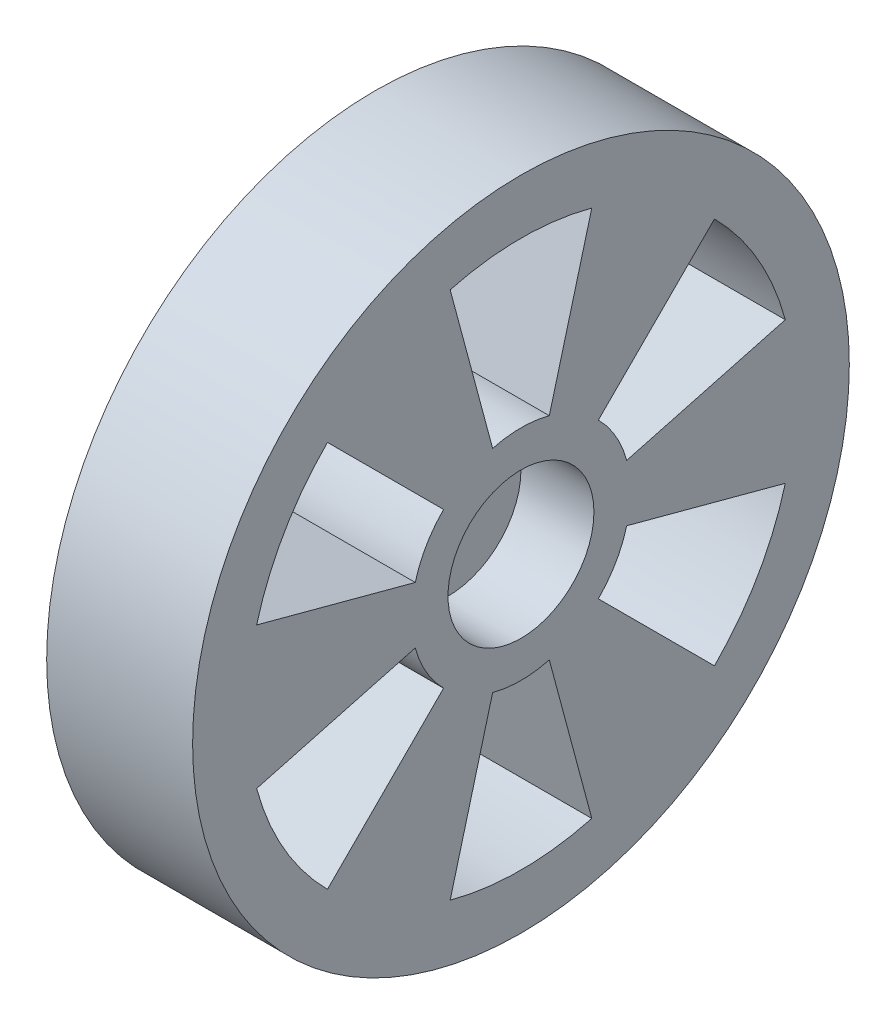
ISO-10303-21;
HEADER;
FILE_DESCRIPTION(('STEP AP214'),'2;1');
FILE_NAME('part.step','',(''),(''),'','','');
FILE_SCHEMA(('AUTOMOTIVE_DESIGN { 1 0 10303 214 1 1 1 1 }'));
ENDSEC;
DATA;
#1=APPLICATION_CONTEXT('core data for automotive mechanical design processes');
#2=APPLICATION_PROTOCOL_DEFINITION('international standard','automotive_design',2000,#1);
#3=PRODUCT_CONTEXT('',#1,'mechanical');
#4=PRODUCT('Part','Part','',(#3));
#5=PRODUCT_RELATED_PRODUCT_CATEGORY('part','',(#4));
#6=PRODUCT_DEFINITION_FORMATION('','',#4);
#7=PRODUCT_DEFINITION_CONTEXT('part definition',#1,'design');
#8=PRODUCT_DEFINITION('design','',#6,#7);
#9=PRODUCT_DEFINITION_SHAPE('','',#8);
#10=(LENGTH_UNIT() NAMED_UNIT(*) SI_UNIT(.MILLI.,.METRE.));
#11=(NAMED_UNIT(*) PLANE_ANGLE_UNIT() SI_UNIT($,.RADIAN.));
#12=(NAMED_UNIT(*) SI_UNIT($,.STERADIAN.) SOLID_ANGLE_UNIT());
#13=UNCERTAINTY_MEASURE_WITH_UNIT(LENGTH_MEASURE(1.E-05),#10,'distance_accuracy_value','');
#14=(GEOMETRIC_REPRESENTATION_CONTEXT(3) GLOBAL_UNCERTAINTY_ASSIGNED_CONTEXT((#13)) GLOBAL_UNIT_ASSIGNED_CONTEXT((#10,
#11,#12)) REPRESENTATION_CONTEXT('',''));
#15=CARTESIAN_POINT('',(0.,0.,0.));
#16=DIRECTION('',(0.,0.,1.));
#17=DIRECTION('',(1.,0.,0.));
#18=AXIS2_PLACEMENT_3D('',#15,#16,#17);
#19=CARTESIAN_POINT('',(20.,0.,0.));
#20=DIRECTION('',(-1.,0.,0.));
#21=DIRECTION('',(0.,0.,1.));
#22=AXIS2_PLACEMENT_3D('',#19,#20,#21);
#23=CYLINDRICAL_SURFACE('',#22,10.);
#24=CARTESIAN_POINT('',(20.,0.,0.));
#25=DIRECTION('',(1.,0.,0.));
#26=DIRECTION('',(0.,0.,-1.));
#27=AXIS2_PLACEMENT_3D('',#24,#25,#26);
#28=CIRCLE('',#27,10.);
#29=CARTESIAN_POINT('',(20.,0.,-10.));
#30=VERTEX_POINT('',#29);
#31=EDGE_CURVE('E11',#30,#30,#28,.T.);
#32=ORIENTED_EDGE('',*,*,#31,.F.);
#33=EDGE_LOOP('',(#32));
#34=FACE_BOUND('',#33,.T.);
#35=CARTESIAN_POINT('',(0.,0.,0.));
#36=DIRECTION('',(1.,0.,0.));
#37=DIRECTION('',(0.,0.,-1.));
#38=AXIS2_PLACEMENT_3D('',#35,#36,#37);
#39=CIRCLE('',#38,10.);
#40=CARTESIAN_POINT('',(0.,0.,-10.));
#41=VERTEX_POINT('',#40);
#42=EDGE_CURVE('E44',#41,#41,#39,.T.);
#43=ORIENTED_EDGE('',*,*,#42,.T.);
#44=EDGE_LOOP('',(#43));
#45=FACE_BOUND('',#44,.T.);
#46=ADVANCED_FACE('F41',(#34,#45),#23,.T.);
#47=CARTESIAN_POINT('',(0.,0.,0.));
#48=DIRECTION('',(1.,0.,0.));
#49=DIRECTION('',(0.,0.,-1.));
#50=AXIS2_PLACEMENT_3D('',#47,#48,#49);
#51=PLANE('',#50);
#52=ORIENTED_EDGE('',*,*,#42,.F.);
#53=EDGE_LOOP('',(#52));
#54=FACE_BOUND('',#53,.T.);
#55=ADVANCED_FACE('F506',(#54),#51,.F.);
#56=CARTESIAN_POINT('',(40.,0.,0.));
#57=DIRECTION('',(-1.,0.,0.));
#58=DIRECTION('',(0.,0.,1.));
#59=AXIS2_PLACEMENT_3D('',#56,#57,#58);
#60=CYLINDRICAL_SURFACE('',#59,45.);
#61=CARTESIAN_POINT('',(40.,0.,0.));
#62=DIRECTION('',(1.,0.,0.));
#63=DIRECTION('',(0.,0.,-1.));
#64=AXIS2_PLACEMENT_3D('',#61,#62,#63);
#65=CIRCLE('',#64,45.);
#66=CARTESIAN_POINT('',(40.,0.,-45.));
#67=VERTEX_POINT('',#66);
#68=EDGE_CURVE('E478',#67,#67,#65,.T.);
#69=ORIENTED_EDGE('',*,*,#68,.F.);
#70=EDGE_LOOP('',(#69));
#71=FACE_BOUND('',#70,.T.);
#72=CARTESIAN_POINT('',(20.,0.,0.));
#73=DIRECTION('',(1.,0.,0.));
#74=DIRECTION('',(0.,0.,-1.));
#75=AXIS2_PLACEMENT_3D('',#72,#73,#74);
#76=CIRCLE('',#75,45.);
#77=CARTESIAN_POINT('',(20.,0.,-45.));
#78=VERTEX_POINT('',#77);
#79=EDGE_CURVE('E468',#78,#78,#76,.T.);
#80=ORIENTED_EDGE('',*,*,#79,.T.);
#81=EDGE_LOOP('',(#80));
#82=FACE_BOUND('',#81,.T.);
#83=ADVANCED_FACE('F486',(#71,#82),#60,.T.);
#84=CARTESIAN_POINT('',(40.,0.,0.));
#85=DIRECTION('',(1.,0.,0.));
#86=DIRECTION('',(0.,0.,-1.));
#87=AXIS2_PLACEMENT_3D('',#84,#85,#86);
#88=PLANE('',#87);
#89=CARTESIAN_POINT('',(40.,0.,0.));
#90=DIRECTION('',(1.,0.,0.));
#91=DIRECTION('',(0.,0.,-1.));
#92=AXIS2_PLACEMENT_3D('',#89,#90,#91);
#93=CIRCLE('',#92,10.);
#94=CARTESIAN_POINT('',(40.,0.,-10.));
#95=VERTEX_POINT('',#94);
#96=EDGE_CURVE('E237',#95,#95,#93,.T.);
#97=ORIENTED_EDGE('',*,*,#96,.F.);
#98=EDGE_LOOP('',(#97));
#99=FACE_BOUND('',#98,.T.);
#100=CARTESIAN_POINT('',(40.,0.,0.));
#101=DIRECTION('',(1.,0.,0.));
#102=DIRECTION('',(0.,0.,1.));
#103=AXIS2_PLACEMENT_3D('',#100,#101,#102);
#104=CIRCLE('',#103,15.);
#105=CARTESIAN_POINT('',(40.,10.6066017177982,10.6066017177982));
#106=VERTEX_POINT('',#105);
#107=CARTESIAN_POINT('',(40.,3.88228567653776,14.488887394336));
#108=VERTEX_POINT('',#107);
#109=EDGE_CURVE('E262',#106,#108,#104,.T.);
#110=ORIENTED_EDGE('',*,*,#109,.T.);
#111=DIRECTION('',(0.,0.258819045102518,0.965925826289069));
#112=VECTOR('',#111,1.);
#113=CARTESIAN_POINT('',(40.,9.70571419134441,36.2222184858401));
#114=LINE('',#113,#112);
#115=CARTESIAN_POINT('',(40.,9.70571419134441,36.2222184858401));
#116=VERTEX_POINT('',#115);
#117=EDGE_CURVE('E266',#108,#116,#114,.T.);
#118=ORIENTED_EDGE('',*,*,#117,.T.);
#119=CARTESIAN_POINT('',(40.,0.,0.));
#120=DIRECTION('',(-1.,0.,0.));
#121=DIRECTION('',(0.,0.,1.));
#122=AXIS2_PLACEMENT_3D('',#119,#120,#121);
#123=CIRCLE('',#122,37.5);
#124=CARTESIAN_POINT('',(40.,26.5165042944955,26.5165042944956));
#125=VERTEX_POINT('',#124);
#126=EDGE_CURVE('E56',#116,#125,#123,.T.);
#127=ORIENTED_EDGE('',*,*,#126,.T.);
#128=DIRECTION('',(0.,-0.707106781186547,-0.707106781186548));
#129=VECTOR('',#128,1.);
#130=CARTESIAN_POINT('',(40.,26.5165042944955,26.5165042944956));
#131=LINE('',#130,#129);
#132=EDGE_CURVE('E273',#125,#106,#131,.T.);
#133=ORIENTED_EDGE('',*,*,#132,.T.);
#134=EDGE_LOOP('',(#110,#118,#127,#133));
#135=FACE_BOUND('',#134,.T.);
#136=CARTESIAN_POINT('',(40.,0.,0.));
#137=DIRECTION('',(1.,0.,0.));
#138=DIRECTION('',(0.,0.,1.));
#139=AXIS2_PLACEMENT_3D('',#136,#137,#138);
#140=CIRCLE('',#139,15.);
#141=CARTESIAN_POINT('',(40.,-3.88228567653787,14.488887394336));
#142=VERTEX_POINT('',#141);
#143=CARTESIAN_POINT('',(40.,-10.6066017177983,10.6066017177982));
#144=VERTEX_POINT('',#143);
#145=EDGE_CURVE('E306',#142,#144,#140,.T.);
#146=ORIENTED_EDGE('',*,*,#145,.T.);
#147=DIRECTION('',(0.,-0.707106781186552,0.707106781186543));
#148=VECTOR('',#147,1.);
#149=CARTESIAN_POINT('',(40.,-26.5165042944957,26.5165042944954));
#150=LINE('',#149,#148);
#151=CARTESIAN_POINT('',(40.,-26.5165042944957,26.5165042944954));
#152=VERTEX_POINT('',#151);
#153=EDGE_CURVE('E310',#144,#152,#150,.T.);
#154=ORIENTED_EDGE('',*,*,#153,.T.);
#155=CARTESIAN_POINT('',(40.,0.,0.));
#156=DIRECTION('',(-1.,0.,0.));
#157=DIRECTION('',(0.,0.,1.));
#158=AXIS2_PLACEMENT_3D('',#155,#156,#157);
#159=CIRCLE('',#158,37.5);
#160=CARTESIAN_POINT('',(40.,-9.70571419134466,36.22221848584));
#161=VERTEX_POINT('',#160);
#162=EDGE_CURVE('E64',#152,#161,#159,.T.);
#163=ORIENTED_EDGE('',*,*,#162,.T.);
#164=DIRECTION('',(0.,0.258819045102524,-0.965925826289067));
#165=VECTOR('',#164,1.);
#166=CARTESIAN_POINT('',(40.,-9.70571419134466,36.22221848584));
#167=LINE('',#166,#165);
#168=EDGE_CURVE('E317',#161,#142,#167,.T.);
#169=ORIENTED_EDGE('',*,*,#168,.T.);
#170=EDGE_LOOP('',(#146,#154,#163,#169));
#171=FACE_BOUND('',#170,.T.);
#172=CARTESIAN_POINT('',(40.,0.,0.));
#173=DIRECTION('',(1.,0.,0.));
#174=DIRECTION('',(0.,0.,1.));
#175=AXIS2_PLACEMENT_3D('',#172,#173,#174);
#176=CIRCLE('',#175,15.);
#177=CARTESIAN_POINT('',(40.,-14.488887394336,3.88228567653772));
#178=VERTEX_POINT('',#177);
#179=CARTESIAN_POINT('',(40.,-14.488887394336,-3.88228567653793));
#180=VERTEX_POINT('',#179);
#181=EDGE_CURVE('E348',#178,#180,#176,.T.);
#182=ORIENTED_EDGE('',*,*,#181,.T.);
#183=DIRECTION('',(0.,-0.965925826289066,-0.258819045102529));
#184=VECTOR('',#183,1.);
#185=CARTESIAN_POINT('',(40.,-36.22221848584,-9.70571419134482));
#186=LINE('',#185,#184);
#187=CARTESIAN_POINT('',(40.,-36.22221848584,-9.70571419134482));
#188=VERTEX_POINT('',#187);
#189=EDGE_CURVE('E352',#180,#188,#186,.T.);
#190=ORIENTED_EDGE('',*,*,#189,.T.);
#191=CARTESIAN_POINT('',(40.,0.,0.));
#192=DIRECTION('',(-1.,0.,0.));
#193=DIRECTION('',(0.,0.,1.));
#194=AXIS2_PLACEMENT_3D('',#191,#192,#193);
#195=CIRCLE('',#194,37.5);
#196=CARTESIAN_POINT('',(40.,-36.2222184858401,9.70571419134432));
#197=VERTEX_POINT('',#196);
#198=EDGE_CURVE('E357',#188,#197,#195,.T.);
#199=ORIENTED_EDGE('',*,*,#198,.T.);
#200=DIRECTION('',(0.,0.96592582628907,-0.258819045102515));
#201=VECTOR('',#200,1.);
#202=CARTESIAN_POINT('',(40.,-36.2222184858401,9.70571419134431));
#203=LINE('',#202,#201);
#204=EDGE_CURVE('E361',#197,#178,#203,.T.);
#205=ORIENTED_EDGE('',*,*,#204,.T.);
#206=EDGE_LOOP('',(#182,#190,#199,#205));
#207=FACE_BOUND('',#206,.T.);
#208=CARTESIAN_POINT('',(40.,0.,0.));
#209=DIRECTION('',(1.,0.,0.));
#210=DIRECTION('',(0.,0.,1.));
#211=AXIS2_PLACEMENT_3D('',#208,#209,#210);
#212=CIRCLE('',#211,15.);
#213=CARTESIAN_POINT('',(40.,-10.6066017177981,-10.6066017177983));
#214=VERTEX_POINT('',#213);
#215=CARTESIAN_POINT('',(40.,-3.88228567653766,-14.4888873943361));
#216=VERTEX_POINT('',#215);
#217=EDGE_CURVE('E392',#214,#216,#212,.T.);
#218=ORIENTED_EDGE('',*,*,#217,.T.);
#219=DIRECTION('',(0.,-0.258819045102511,-0.965925826289071));
#220=VECTOR('',#219,1.);
#221=CARTESIAN_POINT('',(40.,-9.70571419134416,-36.2222184858402));
#222=LINE('',#221,#220);
#223=CARTESIAN_POINT('',(40.,-9.70571419134416,-36.2222184858402));
#224=VERTEX_POINT('',#223);
#225=EDGE_CURVE('E396',#216,#224,#222,.T.);
#226=ORIENTED_EDGE('',*,*,#225,.T.);
#227=CARTESIAN_POINT('',(40.,0.,0.));
#228=DIRECTION('',(-1.,0.,0.));
#229=DIRECTION('',(0.,0.,1.));
#230=AXIS2_PLACEMENT_3D('',#227,#228,#229);
#231=CIRCLE('',#230,37.5);
#232=CARTESIAN_POINT('',(40.,-26.5165042944953,-26.5165042944958));
#233=VERTEX_POINT('',#232);
#234=EDGE_CURVE('E401',#224,#233,#231,.T.);
#235=ORIENTED_EDGE('',*,*,#234,.T.);
#236=DIRECTION('',(0.,0.707106781186542,0.707106781186553));
#237=VECTOR('',#236,1.);
#238=CARTESIAN_POINT('',(40.,-26.5165042944953,-26.5165042944957));
#239=LINE('',#238,#237);
#240=EDGE_CURVE('E405',#233,#214,#239,.T.);
#241=ORIENTED_EDGE('',*,*,#240,.T.);
#242=EDGE_LOOP('',(#218,#226,#235,#241));
#243=FACE_BOUND('',#242,.T.);
#244=CARTESIAN_POINT('',(40.,0.,0.));
#245=DIRECTION('',(1.,0.,0.));
#246=DIRECTION('',(0.,0.,1.));
#247=AXIS2_PLACEMENT_3D('',#244,#245,#246);
#248=CIRCLE('',#247,15.);
#249=CARTESIAN_POINT('',(40.,3.88228567653797,-14.488887394336));
#250=VERTEX_POINT('',#249);
#251=CARTESIAN_POINT('',(40.,10.6066017177983,-10.6066017177981));
#252=VERTEX_POINT('',#251);
#253=EDGE_CURVE('E206',#250,#252,#248,.T.);
#254=ORIENTED_EDGE('',*,*,#253,.T.);
#255=DIRECTION('',(0.,0.707106781186557,-0.707106781186538));
#256=VECTOR('',#255,1.);
#257=CARTESIAN_POINT('',(40.,26.5165042944959,-26.5165042944952));
#258=LINE('',#257,#256);
#259=CARTESIAN_POINT('',(40.,26.5165042944959,-26.5165042944952));
#260=VERTEX_POINT('',#259);
#261=EDGE_CURVE('E219',#252,#260,#258,.T.);
#262=ORIENTED_EDGE('',*,*,#261,.T.);
#263=CARTESIAN_POINT('',(40.,0.,0.));
#264=DIRECTION('',(-1.,0.,0.));
#265=DIRECTION('',(0.,0.,1.));
#266=AXIS2_PLACEMENT_3D('',#263,#264,#265);
#267=CIRCLE('',#266,37.5);
#268=CARTESIAN_POINT('',(40.,9.70571419134491,-36.22221848584));
#269=VERTEX_POINT('',#268);
#270=EDGE_CURVE('E224',#260,#269,#267,.T.);
#271=ORIENTED_EDGE('',*,*,#270,.T.);
#272=DIRECTION('',(0.,-0.258819045102531,0.965925826289065));
#273=VECTOR('',#272,1.);
#274=CARTESIAN_POINT('',(40.,9.70571419134491,-36.22221848584));
#275=LINE('',#274,#273);
#276=EDGE_CURVE('E215',#269,#250,#275,.T.);
#277=ORIENTED_EDGE('',*,*,#276,.T.);
#278=EDGE_LOOP('',(#254,#262,#271,#277));
#279=FACE_BOUND('',#278,.T.);
#280=CARTESIAN_POINT('',(40.,0.,0.));
#281=DIRECTION('',(1.,0.,0.));
#282=DIRECTION('',(0.,0.,1.));
#283=AXIS2_PLACEMENT_3D('',#280,#281,#282);
#284=CIRCLE('',#283,15.);
#285=CARTESIAN_POINT('',(40.,14.488887394336,-3.88228567653782));
#286=VERTEX_POINT('',#285);
#287=CARTESIAN_POINT('',(40.,14.488887394336,3.88228567653782));
#288=VERTEX_POINT('',#287);
#289=EDGE_CURVE('E434',#286,#288,#284,.T.);
#290=ORIENTED_EDGE('',*,*,#289,.T.);
#291=DIRECTION('',(0.,0.965925826289068,0.258819045102522));
#292=VECTOR('',#291,1.);
#293=CARTESIAN_POINT('',(40.,36.2222184858401,9.70571419134456));
#294=LINE('',#293,#292);
#295=CARTESIAN_POINT('',(40.,36.2222184858401,9.70571419134456));
#296=VERTEX_POINT('',#295);
#297=EDGE_CURVE('E438',#288,#296,#294,.T.);
#298=ORIENTED_EDGE('',*,*,#297,.T.);
#299=CARTESIAN_POINT('',(40.,0.,0.));
#300=DIRECTION('',(-1.,0.,0.));
#301=DIRECTION('',(0.,0.,1.));
#302=AXIS2_PLACEMENT_3D('',#299,#300,#301);
#303=CIRCLE('',#302,37.5);
#304=CARTESIAN_POINT('',(40.,36.2222184858401,-9.70571419134456));
#305=VERTEX_POINT('',#304);
#306=EDGE_CURVE('E443',#296,#305,#303,.T.);
#307=ORIENTED_EDGE('',*,*,#306,.T.);
#308=DIRECTION('',(0.,-0.965925826289068,0.258819045102522));
#309=VECTOR('',#308,1.);
#310=CARTESIAN_POINT('',(40.,36.2222184858401,-9.70571419134456));
#311=LINE('',#310,#309);
#312=EDGE_CURVE('E447',#305,#286,#311,.T.);
#313=ORIENTED_EDGE('',*,*,#312,.T.);
#314=EDGE_LOOP('',(#290,#298,#307,#313));
#315=FACE_BOUND('',#314,.T.);
#316=ORIENTED_EDGE('',*,*,#68,.T.);
#317=EDGE_LOOP('',(#316));
#318=FACE_BOUND('',#317,.T.);
#319=ADVANCED_FACE('F226',(#99,#135,#171,#207,#243,#279,#315,#318),#88,.T.);
#320=CARTESIAN_POINT('',(20.,0.,0.));
#321=DIRECTION('',(1.,0.,0.));
#322=DIRECTION('',(0.,0.,-1.));
#323=AXIS2_PLACEMENT_3D('',#320,#321,#322);
#324=PLANE('',#323);
#325=DIRECTION('',(0.,0.258819045102518,0.965925826289069));
#326=VECTOR('',#325,1.);
#327=CARTESIAN_POINT('',(20.,9.70571419134441,36.2222184858401));
#328=LINE('',#327,#326);
#329=CARTESIAN_POINT('',(20.,3.88228567653776,14.488887394336));
#330=VERTEX_POINT('',#329);
#331=CARTESIAN_POINT('',(20.,9.70571419134441,36.2222184858401));
#332=VERTEX_POINT('',#331);
#333=EDGE_CURVE('E281',#330,#332,#328,.T.);
#334=ORIENTED_EDGE('',*,*,#333,.F.);
#335=CARTESIAN_POINT('',(20.,0.,0.));
#336=DIRECTION('',(1.,0.,0.));
#337=DIRECTION('',(0.,0.,1.));
#338=AXIS2_PLACEMENT_3D('',#335,#336,#337);
#339=CIRCLE('',#338,15.);
#340=CARTESIAN_POINT('',(20.,10.6066017177982,10.6066017177982));
#341=VERTEX_POINT('',#340);
#342=EDGE_CURVE('E278',#341,#330,#339,.T.);
#343=ORIENTED_EDGE('',*,*,#342,.F.);
#344=DIRECTION('',(0.,-0.707106781186547,-0.707106781186548));
#345=VECTOR('',#344,1.);
#346=CARTESIAN_POINT('',(20.,26.5165042944955,26.5165042944956));
#347=LINE('',#346,#345);
#348=CARTESIAN_POINT('',(20.,26.5165042944955,26.5165042944956));
#349=VERTEX_POINT('',#348);
#350=EDGE_CURVE('E267',#349,#341,#347,.T.);
#351=ORIENTED_EDGE('',*,*,#350,.F.);
#352=CARTESIAN_POINT('',(20.,0.,0.));
#353=DIRECTION('',(-1.,0.,0.));
#354=DIRECTION('',(0.,0.,1.));
#355=AXIS2_PLACEMENT_3D('',#352,#353,#354);
#356=CIRCLE('',#355,37.5);
#357=EDGE_CURVE('E286',#332,#349,#356,.T.);
#358=ORIENTED_EDGE('',*,*,#357,.F.);
#359=EDGE_LOOP('',(#334,#343,#351,#358));
#360=FACE_BOUND('',#359,.T.);
#361=DIRECTION('',(0.,-0.707106781186552,0.707106781186543));
#362=VECTOR('',#361,1.);
#363=CARTESIAN_POINT('',(20.,-26.5165042944957,26.5165042944954));
#364=LINE('',#363,#362);
#365=CARTESIAN_POINT('',(20.,-10.6066017177983,10.6066017177982));
#366=VERTEX_POINT('',#365);
#367=CARTESIAN_POINT('',(20.,-26.5165042944957,26.5165042944954));
#368=VERTEX_POINT('',#367);
#369=EDGE_CURVE('E325',#366,#368,#364,.T.);
#370=ORIENTED_EDGE('',*,*,#369,.F.);
#371=CARTESIAN_POINT('',(20.,0.,0.));
#372=DIRECTION('',(1.,0.,0.));
#373=DIRECTION('',(0.,0.,1.));
#374=AXIS2_PLACEMENT_3D('',#371,#372,#373);
#375=CIRCLE('',#374,15.);
#376=CARTESIAN_POINT('',(20.,-3.88228567653787,14.488887394336));
#377=VERTEX_POINT('',#376);
#378=EDGE_CURVE('E322',#377,#366,#375,.T.);
#379=ORIENTED_EDGE('',*,*,#378,.F.);
#380=DIRECTION('',(0.,0.258819045102524,-0.965925826289067));
#381=VECTOR('',#380,1.);
#382=CARTESIAN_POINT('',(20.,-9.70571419134466,36.22221848584));
#383=LINE('',#382,#381);
#384=CARTESIAN_POINT('',(20.,-9.70571419134466,36.22221848584));
#385=VERTEX_POINT('',#384);
#386=EDGE_CURVE('E311',#385,#377,#383,.T.);
#387=ORIENTED_EDGE('',*,*,#386,.F.);
#388=CARTESIAN_POINT('',(20.,0.,0.));
#389=DIRECTION('',(-1.,0.,0.));
#390=DIRECTION('',(0.,0.,1.));
#391=AXIS2_PLACEMENT_3D('',#388,#389,#390);
#392=CIRCLE('',#391,37.5);
#393=EDGE_CURVE('E330',#368,#385,#392,.T.);
#394=ORIENTED_EDGE('',*,*,#393,.F.);
#395=EDGE_LOOP('',(#370,#379,#387,#394));
#396=FACE_BOUND('',#395,.T.);
#397=DIRECTION('',(0.,-0.965925826289066,-0.258819045102529));
#398=VECTOR('',#397,1.);
#399=CARTESIAN_POINT('',(20.,-36.22221848584,-9.70571419134482));
#400=LINE('',#399,#398);
#401=CARTESIAN_POINT('',(20.,-14.488887394336,-3.88228567653793));
#402=VERTEX_POINT('',#401);
#403=CARTESIAN_POINT('',(20.,-36.22221848584,-9.70571419134482));
#404=VERTEX_POINT('',#403);
#405=EDGE_CURVE('E369',#402,#404,#400,.T.);
#406=ORIENTED_EDGE('',*,*,#405,.F.);
#407=CARTESIAN_POINT('',(20.,0.,0.));
#408=DIRECTION('',(1.,0.,0.));
#409=DIRECTION('',(0.,0.,1.));
#410=AXIS2_PLACEMENT_3D('',#407,#408,#409);
#411=CIRCLE('',#410,15.);
#412=CARTESIAN_POINT('',(20.,-14.488887394336,3.88228567653772));
#413=VERTEX_POINT('',#412);
#414=EDGE_CURVE('E366',#413,#402,#411,.T.);
#415=ORIENTED_EDGE('',*,*,#414,.F.);
#416=DIRECTION('',(0.,0.96592582628907,-0.258819045102515));
#417=VECTOR('',#416,1.);
#418=CARTESIAN_POINT('',(20.,-36.2222184858401,9.70571419134431));
#419=LINE('',#418,#417);
#420=CARTESIAN_POINT('',(20.,-36.2222184858401,9.70571419134432));
#421=VERTEX_POINT('',#420);
#422=EDGE_CURVE('E353',#421,#413,#419,.T.);
#423=ORIENTED_EDGE('',*,*,#422,.F.);
#424=CARTESIAN_POINT('',(20.,0.,0.));
#425=DIRECTION('',(-1.,0.,0.));
#426=DIRECTION('',(0.,0.,1.));
#427=AXIS2_PLACEMENT_3D('',#424,#425,#426);
#428=CIRCLE('',#427,37.5);
#429=EDGE_CURVE('E374',#404,#421,#428,.T.);
#430=ORIENTED_EDGE('',*,*,#429,.F.);
#431=EDGE_LOOP('',(#406,#415,#423,#430));
#432=FACE_BOUND('',#431,.T.);
#433=DIRECTION('',(0.,-0.258819045102511,-0.965925826289071));
#434=VECTOR('',#433,1.);
#435=CARTESIAN_POINT('',(20.,-9.70571419134416,-36.2222184858402));
#436=LINE('',#435,#434);
#437=CARTESIAN_POINT('',(20.,-3.88228567653767,-14.4888873943361));
#438=VERTEX_POINT('',#437);
#439=CARTESIAN_POINT('',(20.,-9.70571419134416,-36.2222184858402));
#440=VERTEX_POINT('',#439);
#441=EDGE_CURVE('E412',#438,#440,#436,.T.);
#442=ORIENTED_EDGE('',*,*,#441,.F.);
#443=CARTESIAN_POINT('',(20.,0.,0.));
#444=DIRECTION('',(1.,0.,0.));
#445=DIRECTION('',(0.,0.,1.));
#446=AXIS2_PLACEMENT_3D('',#443,#444,#445);
#447=CIRCLE('',#446,15.);
#448=CARTESIAN_POINT('',(20.,-10.6066017177981,-10.6066017177983));
#449=VERTEX_POINT('',#448);
#450=EDGE_CURVE('E256',#449,#438,#447,.T.);
#451=ORIENTED_EDGE('',*,*,#450,.F.);
#452=DIRECTION('',(0.,0.707106781186542,0.707106781186553));
#453=VECTOR('',#452,1.);
#454=CARTESIAN_POINT('',(20.,-26.5165042944953,-26.5165042944957));
#455=LINE('',#454,#453);
#456=CARTESIAN_POINT('',(20.,-26.5165042944953,-26.5165042944958));
#457=VERTEX_POINT('',#456);
#458=EDGE_CURVE('E397',#457,#449,#455,.T.);
#459=ORIENTED_EDGE('',*,*,#458,.F.);
#460=CARTESIAN_POINT('',(20.,0.,0.));
#461=DIRECTION('',(-1.,0.,0.));
#462=DIRECTION('',(0.,0.,1.));
#463=AXIS2_PLACEMENT_3D('',#460,#461,#462);
#464=CIRCLE('',#463,37.5);
#465=EDGE_CURVE('E416',#440,#457,#464,.T.);
#466=ORIENTED_EDGE('',*,*,#465,.F.);
#467=EDGE_LOOP('',(#442,#451,#459,#466));
#468=FACE_BOUND('',#467,.T.);
#469=DIRECTION('',(0.,0.707106781186557,-0.707106781186538));
#470=VECTOR('',#469,1.);
#471=CARTESIAN_POINT('',(20.,26.5165042944959,-26.5165042944952));
#472=LINE('',#471,#470);
#473=CARTESIAN_POINT('',(20.,10.6066017177983,-10.6066017177981));
#474=VERTEX_POINT('',#473);
#475=CARTESIAN_POINT('',(20.,26.5165042944959,-26.5165042944952));
#476=VERTEX_POINT('',#475);
#477=EDGE_CURVE('E246',#474,#476,#472,.T.);
#478=ORIENTED_EDGE('',*,*,#477,.F.);
#479=CARTESIAN_POINT('',(20.,0.,0.));
#480=DIRECTION('',(1.,0.,0.));
#481=DIRECTION('',(0.,0.,1.));
#482=AXIS2_PLACEMENT_3D('',#479,#480,#481);
#483=CIRCLE('',#482,15.);
#484=CARTESIAN_POINT('',(20.,3.88228567653797,-14.488887394336));
#485=VERTEX_POINT('',#484);
#486=EDGE_CURVE('E209',#485,#474,#483,.T.);
#487=ORIENTED_EDGE('',*,*,#486,.F.);
#488=DIRECTION('',(0.,-0.258819045102531,0.965925826289065));
#489=VECTOR('',#488,1.);
#490=CARTESIAN_POINT('',(20.,9.70571419134491,-36.22221848584));
#491=LINE('',#490,#489);
#492=CARTESIAN_POINT('',(20.,9.70571419134491,-36.22221848584));
#493=VERTEX_POINT('',#492);
#494=EDGE_CURVE('E230',#493,#485,#491,.T.);
#495=ORIENTED_EDGE('',*,*,#494,.F.);
#496=CARTESIAN_POINT('',(20.,0.,0.));
#497=DIRECTION('',(-1.,0.,0.));
#498=DIRECTION('',(0.,0.,1.));
#499=AXIS2_PLACEMENT_3D('',#496,#497,#498);
#500=CIRCLE('',#499,37.5);
#501=EDGE_CURVE('E234',#476,#493,#500,.T.);
#502=ORIENTED_EDGE('',*,*,#501,.F.);
#503=EDGE_LOOP('',(#478,#487,#495,#502));
#504=FACE_BOUND('',#503,.T.);
#505=DIRECTION('',(0.,0.965925826289068,0.258819045102522));
#506=VECTOR('',#505,1.);
#507=CARTESIAN_POINT('',(20.,36.2222184858401,9.70571419134456));
#508=LINE('',#507,#506);
#509=CARTESIAN_POINT('',(20.,14.488887394336,3.88228567653782));
#510=VERTEX_POINT('',#509);
#511=CARTESIAN_POINT('',(20.,36.2222184858401,9.70571419134456));
#512=VERTEX_POINT('',#511);
#513=EDGE_CURVE('E454',#510,#512,#508,.T.);
#514=ORIENTED_EDGE('',*,*,#513,.F.);
#515=CARTESIAN_POINT('',(20.,0.,0.));
#516=DIRECTION('',(1.,0.,0.));
#517=DIRECTION('',(0.,0.,1.));
#518=AXIS2_PLACEMENT_3D('',#515,#516,#517);
#519=CIRCLE('',#518,15.);
#520=CARTESIAN_POINT('',(20.,14.488887394336,-3.88228567653782));
#521=VERTEX_POINT('',#520);
#522=EDGE_CURVE('E296',#521,#510,#519,.T.);
#523=ORIENTED_EDGE('',*,*,#522,.F.);
#524=DIRECTION('',(0.,-0.965925826289068,0.258819045102522));
#525=VECTOR('',#524,1.);
#526=CARTESIAN_POINT('',(20.,36.2222184858401,-9.70571419134456));
#527=LINE('',#526,#525);
#528=CARTESIAN_POINT('',(20.,36.2222184858401,-9.70571419134456));
#529=VERTEX_POINT('',#528);
#530=EDGE_CURVE('E439',#529,#521,#527,.T.);
#531=ORIENTED_EDGE('',*,*,#530,.F.);
#532=CARTESIAN_POINT('',(20.,0.,0.));
#533=DIRECTION('',(-1.,0.,0.));
#534=DIRECTION('',(0.,0.,1.));
#535=AXIS2_PLACEMENT_3D('',#532,#533,#534);
#536=CIRCLE('',#535,37.5);
#537=EDGE_CURVE('E458',#512,#529,#536,.T.);
#538=ORIENTED_EDGE('',*,*,#537,.F.);
#539=EDGE_LOOP('',(#514,#523,#531,#538));
#540=FACE_BOUND('',#539,.T.);
#541=ORIENTED_EDGE('',*,*,#31,.T.);
#542=EDGE_LOOP('',(#541));
#543=FACE_BOUND('',#542,.T.);
#544=ORIENTED_EDGE('',*,*,#79,.F.);
#545=EDGE_LOOP('',(#544));
#546=FACE_BOUND('',#545,.T.);
#547=ADVANCED_FACE('F488',(#360,#396,#432,#468,#504,#540,#543,#546),#324,.F.);
#548=CARTESIAN_POINT('',(40.,0.,0.));
#549=DIRECTION('',(-1.,0.,0.));
#550=DIRECTION('',(0.,0.,1.));
#551=AXIS2_PLACEMENT_3D('',#548,#549,#550);
#552=CYLINDRICAL_SURFACE('',#551,15.);
#553=ORIENTED_EDGE('',*,*,#522,.T.);
#554=DIRECTION('',(-1.,0.,0.));
#555=VECTOR('',#554,1.);
#556=CARTESIAN_POINT('',(40.,14.488887394336,3.88228567653782));
#557=LINE('',#556,#555);
#558=EDGE_CURVE('E451',#288,#510,#557,.T.);
#559=ORIENTED_EDGE('',*,*,#558,.F.);
#560=ORIENTED_EDGE('',*,*,#289,.F.);
#561=DIRECTION('',(-1.,0.,0.));
#562=VECTOR('',#561,1.);
#563=CARTESIAN_POINT('',(40.,14.488887394336,-3.88228567653782));
#564=LINE('',#563,#562);
#565=EDGE_CURVE('E465',#286,#521,#564,.T.);
#566=ORIENTED_EDGE('',*,*,#565,.T.);
#567=EDGE_LOOP('',(#553,#559,#560,#566));
#568=FACE_BOUND('',#567,.T.);
#569=ADVANCED_FACE('F490',(#568),#552,.T.);
#570=CARTESIAN_POINT('',(40.,36.2222184858401,-9.70571419134456));
#571=DIRECTION('',(0.,-0.258819045102522,-0.965925826289068));
#572=DIRECTION('',(0.,0.965925826289068,-0.258819045102522));
#573=AXIS2_PLACEMENT_3D('',#570,#571,#572);
#574=PLANE('',#573);
#575=ORIENTED_EDGE('',*,*,#530,.T.);
#576=ORIENTED_EDGE('',*,*,#565,.F.);
#577=ORIENTED_EDGE('',*,*,#312,.F.);
#578=DIRECTION('',(-1.,0.,0.));
#579=VECTOR('',#578,1.);
#580=CARTESIAN_POINT('',(40.,36.2222184858401,-9.70571419134456));
#581=LINE('',#580,#579);
#582=EDGE_CURVE('E469',#305,#529,#581,.T.);
#583=ORIENTED_EDGE('',*,*,#582,.T.);
#584=EDGE_LOOP('',(#575,#576,#577,#583));
#585=FACE_BOUND('',#584,.T.);
#586=ADVANCED_FACE('F497',(#585),#574,.F.);
#587=CARTESIAN_POINT('',(40.,0.,0.));
#588=DIRECTION('',(-1.,0.,0.));
#589=DIRECTION('',(0.,0.,1.));
#590=AXIS2_PLACEMENT_3D('',#587,#588,#589);
#591=CYLINDRICAL_SURFACE('',#590,37.5);
#592=ORIENTED_EDGE('',*,*,#537,.T.);
#593=ORIENTED_EDGE('',*,*,#582,.F.);
#594=ORIENTED_EDGE('',*,*,#306,.F.);
#595=DIRECTION('',(-1.,0.,0.));
#596=VECTOR('',#595,1.);
#597=CARTESIAN_POINT('',(40.,36.2222184858401,9.70571419134456));
#598=LINE('',#597,#596);
#599=EDGE_CURVE('E472',#296,#512,#598,.T.);
#600=ORIENTED_EDGE('',*,*,#599,.T.);
#601=EDGE_LOOP('',(#592,#593,#594,#600));
#602=FACE_BOUND('',#601,.T.);
#603=ADVANCED_FACE('F638',(#602),#591,.F.);
#604=CARTESIAN_POINT('',(40.,36.2222184858401,9.70571419134456));
#605=DIRECTION('',(0.,-0.258819045102522,0.965925826289068));
#606=DIRECTION('',(0.,-0.965925826289068,-0.258819045102522));
#607=AXIS2_PLACEMENT_3D('',#604,#605,#606);
#608=PLANE('',#607);
#609=ORIENTED_EDGE('',*,*,#513,.T.);
#610=ORIENTED_EDGE('',*,*,#599,.F.);
#611=ORIENTED_EDGE('',*,*,#297,.F.);
#612=ORIENTED_EDGE('',*,*,#558,.T.);
#613=EDGE_LOOP('',(#609,#610,#611,#612));
#614=FACE_BOUND('',#613,.T.);
#615=ADVANCED_FACE('F576',(#614),#608,.F.);
#616=CARTESIAN_POINT('',(40.,0.,0.));
#617=DIRECTION('',(-1.,0.,0.));
#618=DIRECTION('',(0.,0.,1.));
#619=AXIS2_PLACEMENT_3D('',#616,#617,#618);
#620=CYLINDRICAL_SURFACE('',#619,15.);
#621=ORIENTED_EDGE('',*,*,#486,.T.);
#622=DIRECTION('',(-1.,0.,0.));
#623=VECTOR('',#622,1.);
#624=CARTESIAN_POINT('',(40.,10.6066017177983,-10.6066017177981));
#625=LINE('',#624,#623);
#626=EDGE_CURVE('E202',#252,#474,#625,.T.);
#627=ORIENTED_EDGE('',*,*,#626,.F.);
#628=ORIENTED_EDGE('',*,*,#253,.F.);
#629=DIRECTION('',(-1.,0.,0.));
#630=VECTOR('',#629,1.);
#631=CARTESIAN_POINT('',(40.,3.88228567653797,-14.488887394336));
#632=LINE('',#631,#630);
#633=EDGE_CURVE('E253',#250,#485,#632,.T.);
#634=ORIENTED_EDGE('',*,*,#633,.T.);
#635=EDGE_LOOP('',(#621,#627,#628,#634));
#636=FACE_BOUND('',#635,.T.);
#637=ADVANCED_FACE('F204',(#636),#620,.T.);
#638=CARTESIAN_POINT('',(40.,9.70571419134491,-36.22221848584));
#639=DIRECTION('',(0.,-0.965925826289066,-0.258819045102531));
#640=DIRECTION('',(0.,0.258819045102531,-0.965925826289066));
#641=AXIS2_PLACEMENT_3D('',#638,#639,#640);
#642=PLANE('',#641);
#643=ORIENTED_EDGE('',*,*,#494,.T.);
#644=ORIENTED_EDGE('',*,*,#633,.F.);
#645=ORIENTED_EDGE('',*,*,#276,.F.);
#646=DIRECTION('',(-1.,0.,0.));
#647=VECTOR('',#646,1.);
#648=CARTESIAN_POINT('',(40.,9.70571419134491,-36.22221848584));
#649=LINE('',#648,#647);
#650=EDGE_CURVE('E257',#269,#493,#649,.T.);
#651=ORIENTED_EDGE('',*,*,#650,.T.);
#652=EDGE_LOOP('',(#643,#644,#645,#651));
#653=FACE_BOUND('',#652,.T.);
#654=ADVANCED_FACE('F563',(#653),#642,.F.);
#655=CARTESIAN_POINT('',(40.,0.,0.));
#656=DIRECTION('',(-1.,0.,0.));
#657=DIRECTION('',(0.,0.,1.));
#658=AXIS2_PLACEMENT_3D('',#655,#656,#657);
#659=CYLINDRICAL_SURFACE('',#658,37.5);
#660=ORIENTED_EDGE('',*,*,#501,.T.);
#661=ORIENTED_EDGE('',*,*,#650,.F.);
#662=ORIENTED_EDGE('',*,*,#270,.F.);
#663=DIRECTION('',(-1.,0.,0.));
#664=VECTOR('',#663,1.);
#665=CARTESIAN_POINT('',(40.,26.5165042944959,-26.5165042944952));
#666=LINE('',#665,#664);
#667=EDGE_CURVE('E214',#260,#476,#666,.T.);
#668=ORIENTED_EDGE('',*,*,#667,.T.);
#669=EDGE_LOOP('',(#660,#661,#662,#668));
#670=FACE_BOUND('',#669,.T.);
#671=ADVANCED_FACE('F566',(#670),#659,.F.);
#672=CARTESIAN_POINT('',(40.,26.5165042944959,-26.5165042944952));
#673=DIRECTION('',(0.,0.707106781186538,0.707106781186557));
#674=DIRECTION('',(0.,-0.707106781186557,0.707106781186538));
#675=AXIS2_PLACEMENT_3D('',#672,#673,#674);
#676=PLANE('',#675);
#677=ORIENTED_EDGE('',*,*,#477,.T.);
#678=ORIENTED_EDGE('',*,*,#667,.F.);
#679=ORIENTED_EDGE('',*,*,#261,.F.);
#680=ORIENTED_EDGE('',*,*,#626,.T.);
#681=EDGE_LOOP('',(#677,#678,#679,#680));
#682=FACE_BOUND('',#681,.T.);
#683=ADVANCED_FACE('F220',(#682),#676,.F.);
#684=CARTESIAN_POINT('',(40.,0.,0.));
#685=DIRECTION('',(-1.,0.,0.));
#686=DIRECTION('',(0.,0.,1.));
#687=AXIS2_PLACEMENT_3D('',#684,#685,#686);
#688=CYLINDRICAL_SURFACE('',#687,15.);
#689=ORIENTED_EDGE('',*,*,#450,.T.);
#690=DIRECTION('',(-1.,0.,0.));
#691=VECTOR('',#690,1.);
#692=CARTESIAN_POINT('',(40.,-3.88228567653766,-14.4888873943361));
#693=LINE('',#692,#691);
#694=EDGE_CURVE('E409',#216,#438,#693,.T.);
#695=ORIENTED_EDGE('',*,*,#694,.F.);
#696=ORIENTED_EDGE('',*,*,#217,.F.);
#697=DIRECTION('',(-1.,0.,0.));
#698=VECTOR('',#697,1.);
#699=CARTESIAN_POINT('',(40.,-10.6066017177981,-10.6066017177983));
#700=LINE('',#699,#698);
#701=EDGE_CURVE('E370',#214,#449,#700,.T.);
#702=ORIENTED_EDGE('',*,*,#701,.T.);
#703=EDGE_LOOP('',(#689,#695,#696,#702));
#704=FACE_BOUND('',#703,.T.);
#705=ADVANCED_FACE('F573',(#704),#688,.T.);
#706=CARTESIAN_POINT('',(40.,-26.5165042944953,-26.5165042944957));
#707=DIRECTION('',(0.,-0.707106781186553,0.707106781186542));
#708=DIRECTION('',(0.,-0.707106781186542,-0.707106781186553));
#709=AXIS2_PLACEMENT_3D('',#706,#707,#708);
#710=PLANE('',#709);
#711=ORIENTED_EDGE('',*,*,#458,.T.);
#712=ORIENTED_EDGE('',*,*,#701,.F.);
#713=ORIENTED_EDGE('',*,*,#240,.F.);
#714=DIRECTION('',(-1.,0.,0.));
#715=VECTOR('',#714,1.);
#716=CARTESIAN_POINT('',(40.,-26.5165042944953,-26.5165042944958));
#717=LINE('',#716,#715);
#718=EDGE_CURVE('E425',#233,#457,#717,.T.);
#719=ORIENTED_EDGE('',*,*,#718,.T.);
#720=EDGE_LOOP('',(#711,#712,#713,#719));
#721=FACE_BOUND('',#720,.T.);
#722=ADVANCED_FACE('F622',(#721),#710,.F.);
#723=CARTESIAN_POINT('',(40.,0.,0.));
#724=DIRECTION('',(-1.,0.,0.));
#725=DIRECTION('',(0.,0.,1.));
#726=AXIS2_PLACEMENT_3D('',#723,#724,#725);
#727=CYLINDRICAL_SURFACE('',#726,37.5);
#728=ORIENTED_EDGE('',*,*,#465,.T.);
#729=ORIENTED_EDGE('',*,*,#718,.F.);
#730=ORIENTED_EDGE('',*,*,#234,.F.);
#731=DIRECTION('',(-1.,0.,0.));
#732=VECTOR('',#731,1.);
#733=CARTESIAN_POINT('',(40.,-9.70571419134416,-36.2222184858402));
#734=LINE('',#733,#732);
#735=EDGE_CURVE('E428',#224,#440,#734,.T.);
#736=ORIENTED_EDGE('',*,*,#735,.T.);
#737=EDGE_LOOP('',(#728,#729,#730,#736));
#738=FACE_BOUND('',#737,.T.);
#739=ADVANCED_FACE('F625',(#738),#727,.F.);
#740=CARTESIAN_POINT('',(40.,-9.70571419134416,-36.2222184858402));
#741=DIRECTION('',(0.,0.965925826289071,-0.258819045102511));
#742=DIRECTION('',(0.,0.258819045102511,0.965925826289071));
#743=AXIS2_PLACEMENT_3D('',#740,#741,#742);
#744=PLANE('',#743);
#745=ORIENTED_EDGE('',*,*,#441,.T.);
#746=ORIENTED_EDGE('',*,*,#735,.F.);
#747=ORIENTED_EDGE('',*,*,#225,.F.);
#748=ORIENTED_EDGE('',*,*,#694,.T.);
#749=EDGE_LOOP('',(#745,#746,#747,#748));
#750=FACE_BOUND('',#749,.T.);
#751=ADVANCED_FACE('F620',(#750),#744,.F.);
#752=CARTESIAN_POINT('',(40.,0.,0.));
#753=DIRECTION('',(-1.,0.,0.));
#754=DIRECTION('',(0.,0.,1.));
#755=AXIS2_PLACEMENT_3D('',#752,#753,#754);
#756=CYLINDRICAL_SURFACE('',#755,15.);
#757=ORIENTED_EDGE('',*,*,#414,.T.);
#758=DIRECTION('',(-1.,0.,0.));
#759=VECTOR('',#758,1.);
#760=CARTESIAN_POINT('',(40.,-14.488887394336,-3.88228567653793));
#761=LINE('',#760,#759);
#762=EDGE_CURVE('E365',#180,#402,#761,.T.);
#763=ORIENTED_EDGE('',*,*,#762,.F.);
#764=ORIENTED_EDGE('',*,*,#181,.F.);
#765=DIRECTION('',(-1.,0.,0.));
#766=VECTOR('',#765,1.);
#767=CARTESIAN_POINT('',(40.,-14.488887394336,3.88228567653772));
#768=LINE('',#767,#766);
#769=EDGE_CURVE('E326',#178,#413,#768,.T.);
#770=ORIENTED_EDGE('',*,*,#769,.T.);
#771=EDGE_LOOP('',(#757,#763,#764,#770));
#772=FACE_BOUND('',#771,.T.);
#773=ADVANCED_FACE('F610',(#772),#756,.T.);
#774=CARTESIAN_POINT('',(40.,-36.2222184858401,9.70571419134431));
#775=DIRECTION('',(0.,0.258819045102515,0.96592582628907));
#776=DIRECTION('',(0.,-0.96592582628907,0.258819045102515));
#777=AXIS2_PLACEMENT_3D('',#774,#775,#776);
#778=PLANE('',#777);
#779=ORIENTED_EDGE('',*,*,#422,.T.);
#780=ORIENTED_EDGE('',*,*,#769,.F.);
#781=ORIENTED_EDGE('',*,*,#204,.F.);
#782=DIRECTION('',(-1.,0.,0.));
#783=VECTOR('',#782,1.);
#784=CARTESIAN_POINT('',(40.,-36.2222184858401,9.70571419134432));
#785=LINE('',#784,#783);
#786=EDGE_CURVE('E383',#197,#421,#785,.T.);
#787=ORIENTED_EDGE('',*,*,#786,.T.);
#788=EDGE_LOOP('',(#779,#780,#781,#787));
#789=FACE_BOUND('',#788,.T.);
#790=ADVANCED_FACE('F606',(#789),#778,.F.);
#791=CARTESIAN_POINT('',(40.,0.,0.));
#792=DIRECTION('',(-1.,0.,0.));
#793=DIRECTION('',(0.,0.,1.));
#794=AXIS2_PLACEMENT_3D('',#791,#792,#793);
#795=CYLINDRICAL_SURFACE('',#794,37.5);
#796=ORIENTED_EDGE('',*,*,#429,.T.);
#797=ORIENTED_EDGE('',*,*,#786,.F.);
#798=ORIENTED_EDGE('',*,*,#198,.F.);
#799=DIRECTION('',(-1.,0.,0.));
#800=VECTOR('',#799,1.);
#801=CARTESIAN_POINT('',(40.,-36.22221848584,-9.70571419134482));
#802=LINE('',#801,#800);
#803=EDGE_CURVE('E386',#188,#404,#802,.T.);
#804=ORIENTED_EDGE('',*,*,#803,.T.);
#805=EDGE_LOOP('',(#796,#797,#798,#804));
#806=FACE_BOUND('',#805,.T.);
#807=ADVANCED_FACE('F609',(#806),#795,.F.);
#808=CARTESIAN_POINT('',(40.,-36.22221848584,-9.70571419134482));
#809=DIRECTION('',(0.,0.258819045102529,-0.965925826289066));
#810=DIRECTION('',(0.,0.965925826289066,0.258819045102529));
#811=AXIS2_PLACEMENT_3D('',#808,#809,#810);
#812=PLANE('',#811);
#813=ORIENTED_EDGE('',*,*,#405,.T.);
#814=ORIENTED_EDGE('',*,*,#803,.F.);
#815=ORIENTED_EDGE('',*,*,#189,.F.);
#816=ORIENTED_EDGE('',*,*,#762,.T.);
#817=EDGE_LOOP('',(#813,#814,#815,#816));
#818=FACE_BOUND('',#817,.T.);
#819=ADVANCED_FACE('F604',(#818),#812,.F.);
#820=CARTESIAN_POINT('',(40.,0.,0.));
#821=DIRECTION('',(-1.,0.,0.));
#822=DIRECTION('',(0.,0.,1.));
#823=AXIS2_PLACEMENT_3D('',#820,#821,#822);
#824=CYLINDRICAL_SURFACE('',#823,15.);
#825=ORIENTED_EDGE('',*,*,#378,.T.);
#826=DIRECTION('',(-1.,0.,0.));
#827=VECTOR('',#826,1.);
#828=CARTESIAN_POINT('',(40.,-10.6066017177983,10.6066017177982));
#829=LINE('',#828,#827);
#830=EDGE_CURVE('E321',#144,#366,#829,.T.);
#831=ORIENTED_EDGE('',*,*,#830,.F.);
#832=ORIENTED_EDGE('',*,*,#145,.F.);
#833=DIRECTION('',(-1.,0.,0.));
#834=VECTOR('',#833,1.);
#835=CARTESIAN_POINT('',(40.,-3.88228567653787,14.488887394336));
#836=LINE('',#835,#834);
#837=EDGE_CURVE('E282',#142,#377,#836,.T.);
#838=ORIENTED_EDGE('',*,*,#837,.T.);
#839=EDGE_LOOP('',(#825,#831,#832,#838));
#840=FACE_BOUND('',#839,.T.);
#841=ADVANCED_FACE('F595',(#840),#824,.T.);
#842=CARTESIAN_POINT('',(40.,-9.70571419134466,36.22221848584));
#843=DIRECTION('',(0.,0.965925826289067,0.258819045102524));
#844=DIRECTION('',(0.,-0.258819045102524,0.965925826289067));
#845=AXIS2_PLACEMENT_3D('',#842,#843,#844);
#846=PLANE('',#845);
#847=ORIENTED_EDGE('',*,*,#386,.T.);
#848=ORIENTED_EDGE('',*,*,#837,.F.);
#849=ORIENTED_EDGE('',*,*,#168,.F.);
#850=DIRECTION('',(-1.,0.,0.));
#851=VECTOR('',#850,1.);
#852=CARTESIAN_POINT('',(40.,-9.70571419134466,36.22221848584));
#853=LINE('',#852,#851);
#854=EDGE_CURVE('E339',#161,#385,#853,.T.);
#855=ORIENTED_EDGE('',*,*,#854,.T.);
#856=EDGE_LOOP('',(#847,#848,#849,#855));
#857=FACE_BOUND('',#856,.T.);
#858=ADVANCED_FACE('F591',(#857),#846,.F.);
#859=CARTESIAN_POINT('',(40.,0.,0.));
#860=DIRECTION('',(-1.,0.,0.));
#861=DIRECTION('',(0.,0.,1.));
#862=AXIS2_PLACEMENT_3D('',#859,#860,#861);
#863=CYLINDRICAL_SURFACE('',#862,37.5);
#864=ORIENTED_EDGE('',*,*,#393,.T.);
#865=ORIENTED_EDGE('',*,*,#854,.F.);
#866=ORIENTED_EDGE('',*,*,#162,.F.);
#867=DIRECTION('',(-1.,0.,0.));
#868=VECTOR('',#867,1.);
#869=CARTESIAN_POINT('',(40.,-26.5165042944957,26.5165042944954));
#870=LINE('',#869,#868);
#871=EDGE_CURVE('E342',#152,#368,#870,.T.);
#872=ORIENTED_EDGE('',*,*,#871,.T.);
#873=EDGE_LOOP('',(#864,#865,#866,#872));
#874=FACE_BOUND('',#873,.T.);
#875=ADVANCED_FACE('F594',(#874),#863,.F.);
#876=CARTESIAN_POINT('',(40.,-26.5165042944957,26.5165042944954));
#877=DIRECTION('',(0.,-0.707106781186543,-0.707106781186552));
#878=DIRECTION('',(0.,0.707106781186552,-0.707106781186543));
#879=AXIS2_PLACEMENT_3D('',#876,#877,#878);
#880=PLANE('',#879);
#881=ORIENTED_EDGE('',*,*,#369,.T.);
#882=ORIENTED_EDGE('',*,*,#871,.F.);
#883=ORIENTED_EDGE('',*,*,#153,.F.);
#884=ORIENTED_EDGE('',*,*,#830,.T.);
#885=EDGE_LOOP('',(#881,#882,#883,#884));
#886=FACE_BOUND('',#885,.T.);
#887=ADVANCED_FACE('F589',(#886),#880,.F.);
#888=CARTESIAN_POINT('',(40.,0.,0.));
#889=DIRECTION('',(-1.,0.,0.));
#890=DIRECTION('',(0.,0.,1.));
#891=AXIS2_PLACEMENT_3D('',#888,#889,#890);
#892=CYLINDRICAL_SURFACE('',#891,15.);
#893=ORIENTED_EDGE('',*,*,#342,.T.);
#894=DIRECTION('',(-1.,0.,0.));
#895=VECTOR('',#894,1.);
#896=CARTESIAN_POINT('',(40.,3.88228567653776,14.488887394336));
#897=LINE('',#896,#895);
#898=EDGE_CURVE('E277',#108,#330,#897,.T.);
#899=ORIENTED_EDGE('',*,*,#898,.F.);
#900=ORIENTED_EDGE('',*,*,#109,.F.);
#901=DIRECTION('',(-1.,0.,0.));
#902=VECTOR('',#901,1.);
#903=CARTESIAN_POINT('',(40.,10.6066017177982,10.6066017177982));
#904=LINE('',#903,#902);
#905=EDGE_CURVE('E293',#106,#341,#904,.T.);
#906=ORIENTED_EDGE('',*,*,#905,.T.);
#907=EDGE_LOOP('',(#893,#899,#900,#906));
#908=FACE_BOUND('',#907,.T.);
#909=ADVANCED_FACE('F581',(#908),#892,.T.);
#910=CARTESIAN_POINT('',(40.,26.5165042944955,26.5165042944956));
#911=DIRECTION('',(0.,0.707106781186548,-0.707106781186547));
#912=DIRECTION('',(0.,0.707106781186547,0.707106781186548));
#913=AXIS2_PLACEMENT_3D('',#910,#911,#912);
#914=PLANE('',#913);
#915=ORIENTED_EDGE('',*,*,#350,.T.);
#916=ORIENTED_EDGE('',*,*,#905,.F.);
#917=ORIENTED_EDGE('',*,*,#132,.F.);
#918=DIRECTION('',(-1.,0.,0.));
#919=VECTOR('',#918,1.);
#920=CARTESIAN_POINT('',(40.,26.5165042944955,26.5165042944956));
#921=LINE('',#920,#919);
#922=EDGE_CURVE('E297',#125,#349,#921,.T.);
#923=ORIENTED_EDGE('',*,*,#922,.T.);
#924=EDGE_LOOP('',(#915,#916,#917,#923));
#925=FACE_BOUND('',#924,.T.);
#926=ADVANCED_FACE('F577',(#925),#914,.F.);
#927=CARTESIAN_POINT('',(40.,0.,0.));
#928=DIRECTION('',(-1.,0.,0.));
#929=DIRECTION('',(0.,0.,1.));
#930=AXIS2_PLACEMENT_3D('',#927,#928,#929);
#931=CYLINDRICAL_SURFACE('',#930,37.5);
#932=ORIENTED_EDGE('',*,*,#357,.T.);
#933=ORIENTED_EDGE('',*,*,#922,.F.);
#934=ORIENTED_EDGE('',*,*,#126,.F.);
#935=DIRECTION('',(-1.,0.,0.));
#936=VECTOR('',#935,1.);
#937=CARTESIAN_POINT('',(40.,9.70571419134441,36.2222184858401));
#938=LINE('',#937,#936);
#939=EDGE_CURVE('E300',#116,#332,#938,.T.);
#940=ORIENTED_EDGE('',*,*,#939,.T.);
#941=EDGE_LOOP('',(#932,#933,#934,#940));
#942=FACE_BOUND('',#941,.T.);
#943=ADVANCED_FACE('F580',(#942),#931,.F.);
#944=CARTESIAN_POINT('',(40.,9.70571419134441,36.2222184858401));
#945=DIRECTION('',(0.,-0.965925826289069,0.258819045102518));
#946=DIRECTION('',(0.,-0.258819045102518,-0.965925826289069));
#947=AXIS2_PLACEMENT_3D('',#944,#945,#946);
#948=PLANE('',#947);
#949=ORIENTED_EDGE('',*,*,#333,.T.);
#950=ORIENTED_EDGE('',*,*,#939,.F.);
#951=ORIENTED_EDGE('',*,*,#117,.F.);
#952=ORIENTED_EDGE('',*,*,#898,.T.);
#953=EDGE_LOOP('',(#949,#950,#951,#952));
#954=FACE_BOUND('',#953,.T.);
#955=ADVANCED_FACE('F537',(#954),#948,.F.);
#956=CARTESIAN_POINT('',(30.,0.,0.));
#957=DIRECTION('',(1.,0.,0.));
#958=DIRECTION('',(0.,0.,-1.));
#959=AXIS2_PLACEMENT_3D('',#956,#957,#958);
#960=CYLINDRICAL_SURFACE('',#959,10.);
#961=CARTESIAN_POINT('',(30.,0.,0.));
#962=DIRECTION('',(1.,0.,0.));
#963=DIRECTION('',(0.,0.,-1.));
#964=AXIS2_PLACEMENT_3D('',#961,#962,#963);
#965=CIRCLE('',#964,10.);
#966=CARTESIAN_POINT('',(30.,0.,-10.));
#967=VERTEX_POINT('',#966);
#968=EDGE_CURVE('E247',#967,#967,#965,.T.);
#969=ORIENTED_EDGE('',*,*,#968,.F.);
#970=EDGE_LOOP('',(#969));
#971=FACE_BOUND('',#970,.T.);
#972=ORIENTED_EDGE('',*,*,#96,.T.);
#973=EDGE_LOOP('',(#972));
#974=FACE_BOUND('',#973,.T.);
#975=ADVANCED_FACE('F542',(#971,#974),#960,.F.);
#976=CARTESIAN_POINT('',(30.,0.,0.));
#977=DIRECTION('',(1.,0.,0.));
#978=DIRECTION('',(0.,0.,-1.));
#979=AXIS2_PLACEMENT_3D('',#976,#977,#978);
#980=PLANE('',#979);
#981=ORIENTED_EDGE('',*,*,#968,.T.);
#982=EDGE_LOOP('',(#981));
#983=FACE_BOUND('',#982,.T.);
#984=ADVANCED_FACE('F547',(#983),#980,.T.);
#985=CLOSED_SHELL('',(#46,#55,#83,#319,#547,#569,#586,#603,#615,#637,#654,#671,#683,#705,#722,
#739,#751,#773,#790,#807,#819,#841,#858,#875,#887,#909,#926,#943,#955,#975,#984));
#986=MANIFOLD_SOLID_BREP('B2',#985);
#987=ADVANCED_BREP_SHAPE_REPRESENTATION('',(#18,#986),#14);
#988=SHAPE_DEFINITION_REPRESENTATION(#9,#987);
ENDSEC;
END-ISO-10303-21;
